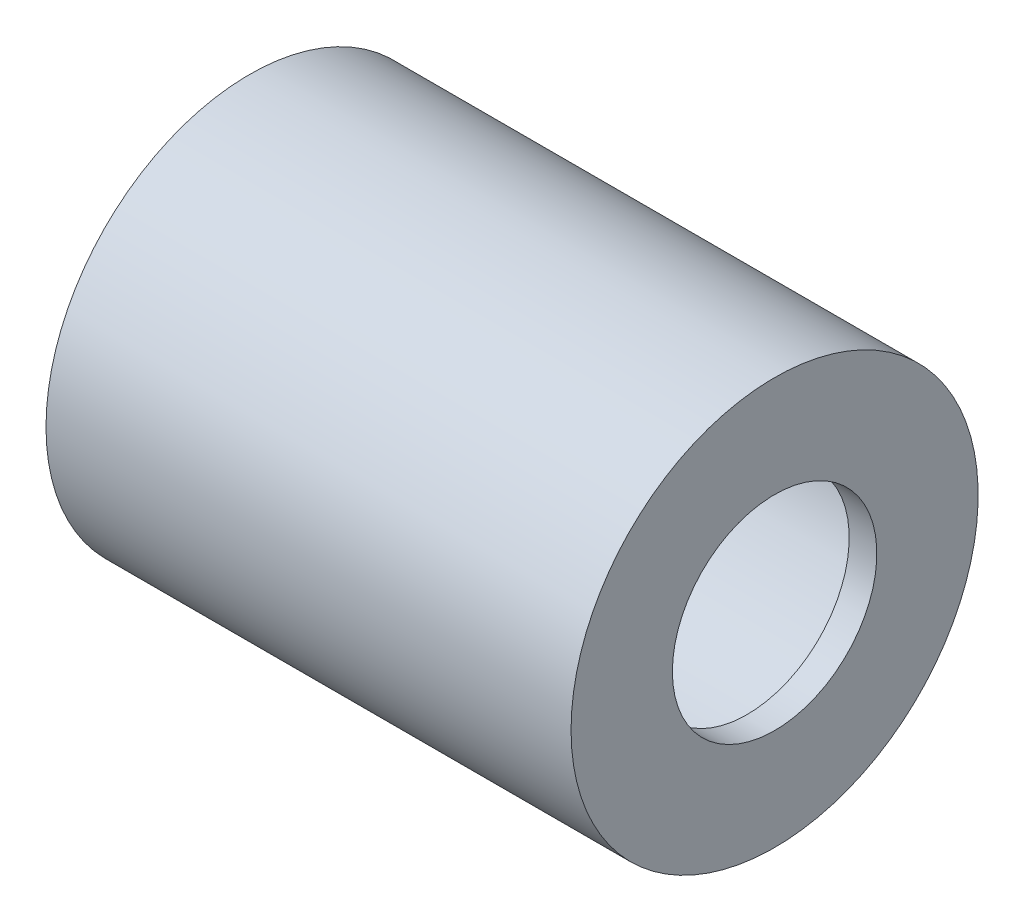
ISO-10303-21;
HEADER;
FILE_DESCRIPTION(('STEP AP214'),'2;1');
FILE_NAME('part.step','',(''),(''),'','','');
FILE_SCHEMA(('AUTOMOTIVE_DESIGN { 1 0 10303 214 1 1 1 1 }'));
ENDSEC;
DATA;
#1=APPLICATION_CONTEXT('core data for automotive mechanical design processes');
#2=APPLICATION_PROTOCOL_DEFINITION('international standard','automotive_design',2000,#1);
#3=PRODUCT_CONTEXT('',#1,'mechanical');
#4=PRODUCT('Part','Part','',(#3));
#5=PRODUCT_RELATED_PRODUCT_CATEGORY('part','',(#4));
#6=PRODUCT_DEFINITION_FORMATION('','',#4);
#7=PRODUCT_DEFINITION_CONTEXT('part definition',#1,'design');
#8=PRODUCT_DEFINITION('design','',#6,#7);
#9=PRODUCT_DEFINITION_SHAPE('','',#8);
#10=(LENGTH_UNIT() NAMED_UNIT(*) SI_UNIT(.MILLI.,.METRE.));
#11=(NAMED_UNIT(*) PLANE_ANGLE_UNIT() SI_UNIT($,.RADIAN.));
#12=(NAMED_UNIT(*) SI_UNIT($,.STERADIAN.) SOLID_ANGLE_UNIT());
#13=UNCERTAINTY_MEASURE_WITH_UNIT(LENGTH_MEASURE(1.E-05),#10,'distance_accuracy_value','');
#14=(GEOMETRIC_REPRESENTATION_CONTEXT(3) GLOBAL_UNCERTAINTY_ASSIGNED_CONTEXT((#13)) GLOBAL_UNIT_ASSIGNED_CONTEXT((#10,
#11,#12)) REPRESENTATION_CONTEXT('',''));
#15=CARTESIAN_POINT('',(0.,0.,0.));
#16=DIRECTION('',(0.,0.,1.));
#17=DIRECTION('',(1.,0.,0.));
#18=AXIS2_PLACEMENT_3D('',#15,#16,#17);
#19=CARTESIAN_POINT('',(19.4089068717294,9.00617287845862,0.));
#20=DIRECTION('',(1.,0.,0.));
#21=DIRECTION('',(0.,0.,-1.));
#22=AXIS2_PLACEMENT_3D('',#19,#20,#21);
#23=PLANE('',#22);
#24=CARTESIAN_POINT('',(19.4089068717294,-2.09382712154138,0.));
#25=DIRECTION('',(-1.,0.,0.));
#26=DIRECTION('',(0.,0.,1.));
#27=AXIS2_PLACEMENT_3D('',#24,#25,#26);
#28=CIRCLE('',#27,11.1);
#29=CARTESIAN_POINT('',(19.4089068717294,-2.09382712154138,11.1));
#30=VERTEX_POINT('',#29);
#31=EDGE_CURVE('E10',#30,#30,#28,.T.);
#32=ORIENTED_EDGE('',*,*,#31,.F.);
#33=EDGE_LOOP('',(#32));
#34=FACE_BOUND('',#33,.T.);
#35=CARTESIAN_POINT('',(19.4089068717294,-2.09382712154138,0.));
#36=DIRECTION('',(-1.,0.,0.));
#37=DIRECTION('',(0.,0.,1.));
#38=AXIS2_PLACEMENT_3D('',#35,#36,#37);
#39=CIRCLE('',#38,19.1);
#40=CARTESIAN_POINT('',(19.4089068717294,-2.09382712154138,19.1));
#41=VERTEX_POINT('',#40);
#42=EDGE_CURVE('E68',#41,#41,#39,.T.);
#43=ORIENTED_EDGE('',*,*,#42,.T.);
#44=EDGE_LOOP('',(#43));
#45=FACE_BOUND('',#44,.T.);
#46=ADVANCED_FACE('F41',(#34,#45),#23,.F.);
#47=CARTESIAN_POINT('',(-16.7626873949071,-2.09382712154138,0.));
#48=DIRECTION('',(-1.,0.,0.));
#49=DIRECTION('',(0.,0.,1.));
#50=AXIS2_PLACEMENT_3D('',#47,#48,#49);
#51=CYLINDRICAL_SURFACE('',#50,11.1);
#52=CARTESIAN_POINT('',(22.4089068717293,-2.09382712154138,0.));
#53=DIRECTION('',(-1.,0.,0.));
#54=DIRECTION('',(0.,0.,1.));
#55=AXIS2_PLACEMENT_3D('',#52,#53,#54);
#56=CIRCLE('',#55,11.1);
#57=CARTESIAN_POINT('',(22.4089068717293,-2.09382712154138,11.1));
#58=VERTEX_POINT('',#57);
#59=EDGE_CURVE('E48',#58,#58,#56,.T.);
#60=ORIENTED_EDGE('',*,*,#59,.F.);
#61=EDGE_LOOP('',(#60));
#62=FACE_BOUND('',#61,.T.);
#63=ORIENTED_EDGE('',*,*,#31,.T.);
#64=EDGE_LOOP('',(#63));
#65=FACE_BOUND('',#64,.T.);
#66=ADVANCED_FACE('F94',(#62,#65),#51,.F.);
#67=CARTESIAN_POINT('',(22.4089068717294,9.00617287845862,0.));
#68=DIRECTION('',(-1.,0.,0.));
#69=DIRECTION('',(0.,0.,1.));
#70=AXIS2_PLACEMENT_3D('',#67,#68,#69);
#71=PLANE('',#70);
#72=CARTESIAN_POINT('',(22.4089068717293,-2.09382712154138,0.));
#73=DIRECTION('',(-1.,0.,0.));
#74=DIRECTION('',(0.,0.,1.));
#75=AXIS2_PLACEMENT_3D('',#72,#73,#74);
#76=CIRCLE('',#75,22.1);
#77=CARTESIAN_POINT('',(22.4089068717293,-2.09382712154138,22.1));
#78=VERTEX_POINT('',#77);
#79=EDGE_CURVE('E53',#78,#78,#76,.T.);
#80=ORIENTED_EDGE('',*,*,#79,.F.);
#81=EDGE_LOOP('',(#80));
#82=FACE_BOUND('',#81,.T.);
#83=ORIENTED_EDGE('',*,*,#59,.T.);
#84=EDGE_LOOP('',(#83));
#85=FACE_BOUND('',#84,.T.);
#86=ADVANCED_FACE('F89',(#82,#85),#71,.F.);
#87=CARTESIAN_POINT('',(-16.7626873949071,-2.09382712154138,0.));
#88=DIRECTION('',(-1.,0.,0.));
#89=DIRECTION('',(0.,0.,1.));
#90=AXIS2_PLACEMENT_3D('',#87,#88,#89);
#91=CYLINDRICAL_SURFACE('',#90,22.1);
#92=CARTESIAN_POINT('',(-34.5975189934688,-2.09382712154138,0.));
#93=DIRECTION('',(-1.,0.,0.));
#94=DIRECTION('',(0.,0.,1.));
#95=AXIS2_PLACEMENT_3D('',#92,#93,#94);
#96=CIRCLE('',#95,22.1);
#97=CARTESIAN_POINT('',(-34.5975189934688,-2.09382712154138,22.1));
#98=VERTEX_POINT('',#97);
#99=EDGE_CURVE('E58',#98,#98,#96,.T.);
#100=ORIENTED_EDGE('',*,*,#99,.F.);
#101=EDGE_LOOP('',(#100));
#102=FACE_BOUND('',#101,.T.);
#103=ORIENTED_EDGE('',*,*,#79,.T.);
#104=EDGE_LOOP('',(#103));
#105=FACE_BOUND('',#104,.T.);
#106=ADVANCED_FACE('F83',(#102,#105),#91,.T.);
#107=CARTESIAN_POINT('',(-34.5975189934688,17.0061728784586,0.));
#108=DIRECTION('',(1.,0.,0.));
#109=DIRECTION('',(0.,0.,-1.));
#110=AXIS2_PLACEMENT_3D('',#107,#108,#109);
#111=PLANE('',#110);
#112=CARTESIAN_POINT('',(-34.5975189934688,-2.09382712154138,0.));
#113=DIRECTION('',(-1.,0.,0.));
#114=DIRECTION('',(0.,0.,1.));
#115=AXIS2_PLACEMENT_3D('',#112,#113,#114);
#116=CIRCLE('',#115,19.1);
#117=CARTESIAN_POINT('',(-34.5975189934688,-2.09382712154138,19.1));
#118=VERTEX_POINT('',#117);
#119=EDGE_CURVE('E64',#118,#118,#116,.T.);
#120=ORIENTED_EDGE('',*,*,#119,.F.);
#121=EDGE_LOOP('',(#120));
#122=FACE_BOUND('',#121,.T.);
#123=ORIENTED_EDGE('',*,*,#99,.T.);
#124=EDGE_LOOP('',(#123));
#125=FACE_BOUND('',#124,.T.);
#126=ADVANCED_FACE('F77',(#122,#125),#111,.F.);
#127=CARTESIAN_POINT('',(-16.7626873949071,-2.09382712154138,0.));
#128=DIRECTION('',(-1.,0.,0.));
#129=DIRECTION('',(0.,0.,1.));
#130=AXIS2_PLACEMENT_3D('',#127,#128,#129);
#131=CYLINDRICAL_SURFACE('',#130,19.1);
#132=ORIENTED_EDGE('',*,*,#42,.F.);
#133=EDGE_LOOP('',(#132));
#134=FACE_BOUND('',#133,.T.);
#135=ORIENTED_EDGE('',*,*,#119,.T.);
#136=EDGE_LOOP('',(#135));
#137=FACE_BOUND('',#136,.T.);
#138=ADVANCED_FACE('F74',(#134,#137),#131,.F.);
#139=CLOSED_SHELL('',(#46,#66,#86,#106,#126,#138));
#140=MANIFOLD_SOLID_BREP('B2',#139);
#141=ADVANCED_BREP_SHAPE_REPRESENTATION('',(#18,#140),#14);
#142=SHAPE_DEFINITION_REPRESENTATION(#9,#141);
ENDSEC;
END-ISO-10303-21;
